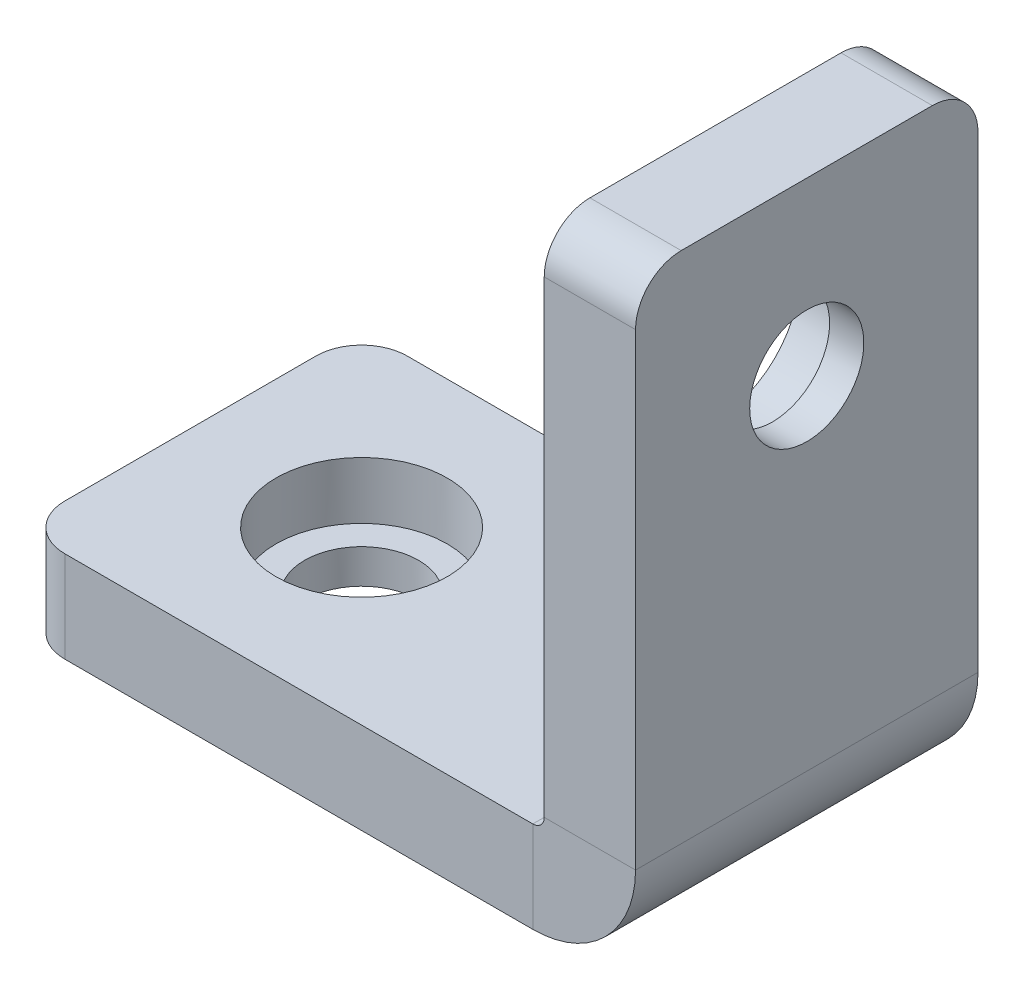
ISO-10303-21;
HEADER;
FILE_DESCRIPTION(('STEP AP214'),'2;1');
FILE_NAME('part.step','',(''),(''),'','','');
FILE_SCHEMA(('AUTOMOTIVE_DESIGN { 1 0 10303 214 1 1 1 1 }'));
ENDSEC;
DATA;
#1=APPLICATION_CONTEXT('core data for automotive mechanical design processes');
#2=APPLICATION_PROTOCOL_DEFINITION('international standard','automotive_design',2000,#1);
#3=PRODUCT_CONTEXT('',#1,'mechanical');
#4=PRODUCT('Part','Part','',(#3));
#5=PRODUCT_RELATED_PRODUCT_CATEGORY('part','',(#4));
#6=PRODUCT_DEFINITION_FORMATION('','',#4);
#7=PRODUCT_DEFINITION_CONTEXT('part definition',#1,'design');
#8=PRODUCT_DEFINITION('design','',#6,#7);
#9=PRODUCT_DEFINITION_SHAPE('','',#8);
#10=(LENGTH_UNIT() NAMED_UNIT(*) SI_UNIT(.MILLI.,.METRE.));
#11=(NAMED_UNIT(*) PLANE_ANGLE_UNIT() SI_UNIT($,.RADIAN.));
#12=(NAMED_UNIT(*) SI_UNIT($,.STERADIAN.) SOLID_ANGLE_UNIT());
#13=UNCERTAINTY_MEASURE_WITH_UNIT(LENGTH_MEASURE(1.E-05),#10,'distance_accuracy_value','');
#14=(GEOMETRIC_REPRESENTATION_CONTEXT(3) GLOBAL_UNCERTAINTY_ASSIGNED_CONTEXT((#13)) GLOBAL_UNIT_ASSIGNED_CONTEXT((#10,
#11,#12)) REPRESENTATION_CONTEXT('',''));
#15=CARTESIAN_POINT('',(0.,0.,0.));
#16=DIRECTION('',(0.,0.,1.));
#17=DIRECTION('',(1.,0.,0.));
#18=AXIS2_PLACEMENT_3D('',#15,#16,#17);
#19=CARTESIAN_POINT('',(-25.,0.,0.));
#20=DIRECTION('',(-1.,0.,0.));
#21=DIRECTION('',(0.,0.,1.));
#22=AXIS2_PLACEMENT_3D('',#19,#20,#21);
#23=PLANE('',#22);
#24=DIRECTION('',(0.,0.,1.));
#25=VECTOR('',#24,1.);
#26=CARTESIAN_POINT('',(-25.,2.,7.5));
#27=LINE('',#26,#25);
#28=CARTESIAN_POINT('',(-25.,2.,-5.5));
#29=VERTEX_POINT('',#28);
#30=CARTESIAN_POINT('',(-25.,2.,5.5));
#31=VERTEX_POINT('',#30);
#32=EDGE_CURVE('E200',#29,#31,#27,.T.);
#33=ORIENTED_EDGE('',*,*,#32,.F.);
#34=DIRECTION('',(0.,1.,0.));
#35=VECTOR('',#34,1.);
#36=CARTESIAN_POINT('',(-25.,0.,-5.5));
#37=LINE('',#36,#35);
#38=CARTESIAN_POINT('',(-25.,-2.,-5.5));
#39=VERTEX_POINT('',#38);
#40=EDGE_CURVE('E66',#29,#39,#37,.F.);
#41=ORIENTED_EDGE('',*,*,#40,.T.);
#42=DIRECTION('',(0.,0.,-1.));
#43=VECTOR('',#42,1.);
#44=CARTESIAN_POINT('',(-25.,-2.,7.5));
#45=LINE('',#44,#43);
#46=CARTESIAN_POINT('',(-25.,-2.,5.5));
#47=VERTEX_POINT('',#46);
#48=EDGE_CURVE('E149',#47,#39,#45,.T.);
#49=ORIENTED_EDGE('',*,*,#48,.F.);
#50=DIRECTION('',(0.,-1.,0.));
#51=VECTOR('',#50,1.);
#52=CARTESIAN_POINT('',(-25.,0.,5.5));
#53=LINE('',#52,#51);
#54=EDGE_CURVE('E283',#47,#31,#53,.F.);
#55=ORIENTED_EDGE('',*,*,#54,.T.);
#56=EDGE_LOOP('',(#33,#41,#49,#55));
#57=FACE_BOUND('',#56,.T.);
#58=ADVANCED_FACE('F41',(#57),#23,.T.);
#59=CARTESIAN_POINT('',(0.,25.,0.));
#60=DIRECTION('',(0.,-1.,0.));
#61=DIRECTION('',(0.,0.,1.));
#62=AXIS2_PLACEMENT_3D('',#59,#60,#61);
#63=PLANE('',#62);
#64=DIRECTION('',(0.,0.,-1.));
#65=VECTOR('',#64,1.);
#66=CARTESIAN_POINT('',(2.,25.,7.5));
#67=LINE('',#66,#65);
#68=CARTESIAN_POINT('',(2.,25.,5.5));
#69=VERTEX_POINT('',#68);
#70=CARTESIAN_POINT('',(2.,25.,-5.5));
#71=VERTEX_POINT('',#70);
#72=EDGE_CURVE('E239',#69,#71,#67,.T.);
#73=ORIENTED_EDGE('',*,*,#72,.T.);
#74=DIRECTION('',(-1.,0.,0.));
#75=VECTOR('',#74,1.);
#76=CARTESIAN_POINT('',(-2.,25.,-5.5));
#77=LINE('',#76,#75);
#78=CARTESIAN_POINT('',(-2.,25.,-5.5));
#79=VERTEX_POINT('',#78);
#80=EDGE_CURVE('E252',#71,#79,#77,.T.);
#81=ORIENTED_EDGE('',*,*,#80,.T.);
#82=DIRECTION('',(0.,0.,1.));
#83=VECTOR('',#82,1.);
#84=CARTESIAN_POINT('',(-2.,25.,7.5));
#85=LINE('',#84,#83);
#86=CARTESIAN_POINT('',(-2.,25.,5.5));
#87=VERTEX_POINT('',#86);
#88=EDGE_CURVE('E194',#79,#87,#85,.T.);
#89=ORIENTED_EDGE('',*,*,#88,.T.);
#90=DIRECTION('',(1.,0.,0.));
#91=VECTOR('',#90,1.);
#92=CARTESIAN_POINT('',(2.,25.,5.5));
#93=LINE('',#92,#91);
#94=EDGE_CURVE('E248',#87,#69,#93,.T.);
#95=ORIENTED_EDGE('',*,*,#94,.T.);
#96=EDGE_LOOP('',(#73,#81,#89,#95));
#97=FACE_BOUND('',#96,.T.);
#98=ADVANCED_FACE('F357',(#97),#63,.F.);
#99=CARTESIAN_POINT('',(-25.,-2.,-7.5));
#100=DIRECTION('',(0.,0.,-1.));
#101=DIRECTION('',(-1.,0.,0.));
#102=AXIS2_PLACEMENT_3D('',#99,#100,#101);
#103=PLANE('',#102);
#104=DIRECTION('',(1.,0.,0.));
#105=VECTOR('',#104,1.);
#106=CARTESIAN_POINT('',(-25.,-2.,-7.5));
#107=LINE('',#106,#105);
#108=CARTESIAN_POINT('',(-23.,-2.,-7.5));
#109=VERTEX_POINT('',#108);
#110=CARTESIAN_POINT('',(-2.50000000000002,-2.,-7.5));
#111=VERTEX_POINT('',#110);
#112=EDGE_CURVE('E135',#109,#111,#107,.T.);
#113=ORIENTED_EDGE('',*,*,#112,.F.);
#114=DIRECTION('',(0.,1.,0.));
#115=VECTOR('',#114,1.);
#116=CARTESIAN_POINT('',(-23.,-2.,-7.5));
#117=LINE('',#116,#115);
#118=CARTESIAN_POINT('',(-23.,2.,-7.5));
#119=VERTEX_POINT('',#118);
#120=EDGE_CURVE('E274',#109,#119,#117,.T.);
#121=ORIENTED_EDGE('',*,*,#120,.T.);
#122=DIRECTION('',(1.,0.,0.));
#123=VECTOR('',#122,1.);
#124=CARTESIAN_POINT('',(-25.,2.,-7.5));
#125=LINE('',#124,#123);
#126=CARTESIAN_POINT('',(-2.50000000000002,2.,-7.5));
#127=VERTEX_POINT('',#126);
#128=EDGE_CURVE('E173',#119,#127,#125,.T.);
#129=ORIENTED_EDGE('',*,*,#128,.T.);
#130=DIRECTION('',(0.,1.,0.));
#131=VECTOR('',#130,1.);
#132=CARTESIAN_POINT('',(-2.50000000000002,-2.,-7.5));
#133=LINE('',#132,#131);
#134=EDGE_CURVE('E148',#111,#127,#133,.T.);
#135=ORIENTED_EDGE('',*,*,#134,.F.);
#136=EDGE_LOOP('',(#113,#121,#129,#135));
#137=FACE_BOUND('',#136,.T.);
#138=ADVANCED_FACE('F171',(#137),#103,.T.);
#139=CARTESIAN_POINT('',(-25.,2.,7.5));
#140=DIRECTION('',(0.,1.,0.));
#141=DIRECTION('',(0.,0.,1.));
#142=AXIS2_PLACEMENT_3D('',#139,#140,#141);
#143=PLANE('',#142);
#144=CARTESIAN_POINT('',(-17.5,2.,0.));
#145=DIRECTION('',(0.,1.,0.));
#146=DIRECTION('',(0.,0.,1.));
#147=AXIS2_PLACEMENT_3D('',#144,#145,#146);
#148=CIRCLE('',#147,3.75);
#149=CARTESIAN_POINT('',(-17.5,2.,3.75));
#150=VERTEX_POINT('',#149);
#151=EDGE_CURVE('E316',#150,#150,#148,.T.);
#152=ORIENTED_EDGE('',*,*,#151,.F.);
#153=EDGE_LOOP('',(#152));
#154=FACE_BOUND('',#153,.T.);
#155=ORIENTED_EDGE('',*,*,#128,.F.);
#156=CARTESIAN_POINT('',(-23.,2.,-5.5));
#157=DIRECTION('',(0.,1.,0.));
#158=DIRECTION('',(0.,0.,1.));
#159=AXIS2_PLACEMENT_3D('',#156,#157,#158);
#160=CIRCLE('',#159,2.);
#161=EDGE_CURVE('E280',#119,#29,#160,.T.);
#162=ORIENTED_EDGE('',*,*,#161,.T.);
#163=ORIENTED_EDGE('',*,*,#32,.T.);
#164=CARTESIAN_POINT('',(-23.,2.,5.5));
#165=DIRECTION('',(0.,1.,0.));
#166=DIRECTION('',(0.,0.,1.));
#167=AXIS2_PLACEMENT_3D('',#164,#165,#166);
#168=CIRCLE('',#167,2.);
#169=CARTESIAN_POINT('',(-23.,2.,7.5));
#170=VERTEX_POINT('',#169);
#171=EDGE_CURVE('E277',#31,#170,#168,.T.);
#172=ORIENTED_EDGE('',*,*,#171,.T.);
#173=DIRECTION('',(1.,0.,0.));
#174=VECTOR('',#173,1.);
#175=CARTESIAN_POINT('',(-25.,2.,7.5));
#176=LINE('',#175,#174);
#177=CARTESIAN_POINT('',(-2.50000000000002,2.,7.5));
#178=VERTEX_POINT('',#177);
#179=EDGE_CURVE('E207',#170,#178,#176,.T.);
#180=ORIENTED_EDGE('',*,*,#179,.T.);
#181=DIRECTION('',(0.,0.,1.));
#182=VECTOR('',#181,1.);
#183=CARTESIAN_POINT('',(-2.50000000000002,2.,7.5));
#184=LINE('',#183,#182);
#185=EDGE_CURVE('E178',#127,#178,#184,.T.);
#186=ORIENTED_EDGE('',*,*,#185,.F.);
#187=EDGE_LOOP('',(#155,#162,#163,#172,#180,#186));
#188=FACE_BOUND('',#187,.T.);
#189=ADVANCED_FACE('F324',(#154,#188),#143,.T.);
#190=CARTESIAN_POINT('',(-25.,-2.,7.5));
#191=DIRECTION('',(0.,0.,1.));
#192=DIRECTION('',(1.,0.,0.));
#193=AXIS2_PLACEMENT_3D('',#190,#191,#192);
#194=PLANE('',#193);
#195=ORIENTED_EDGE('',*,*,#179,.F.);
#196=DIRECTION('',(0.,-1.,0.));
#197=VECTOR('',#196,1.);
#198=CARTESIAN_POINT('',(-23.,-2.,7.5));
#199=LINE('',#198,#197);
#200=CARTESIAN_POINT('',(-23.,-2.,7.5));
#201=VERTEX_POINT('',#200);
#202=EDGE_CURVE('E12',#170,#201,#199,.T.);
#203=ORIENTED_EDGE('',*,*,#202,.T.);
#204=DIRECTION('',(1.,0.,0.));
#205=VECTOR('',#204,1.);
#206=CARTESIAN_POINT('',(-25.,-2.,7.5));
#207=LINE('',#206,#205);
#208=CARTESIAN_POINT('',(-2.50000000000002,-2.,7.5));
#209=VERTEX_POINT('',#208);
#210=EDGE_CURVE('E169',#201,#209,#207,.T.);
#211=ORIENTED_EDGE('',*,*,#210,.T.);
#212=DIRECTION('',(0.,-1.,0.));
#213=VECTOR('',#212,1.);
#214=CARTESIAN_POINT('',(-2.50000000000002,-2.,7.5));
#215=LINE('',#214,#213);
#216=EDGE_CURVE('E210',#178,#209,#215,.T.);
#217=ORIENTED_EDGE('',*,*,#216,.F.);
#218=EDGE_LOOP('',(#195,#203,#211,#217));
#219=FACE_BOUND('',#218,.T.);
#220=ADVANCED_FACE('F327',(#219),#194,.T.);
#221=CARTESIAN_POINT('',(-25.,-2.,7.5));
#222=DIRECTION('',(0.,-1.,0.));
#223=DIRECTION('',(0.,0.,-1.));
#224=AXIS2_PLACEMENT_3D('',#221,#222,#223);
#225=PLANE('',#224);
#226=CARTESIAN_POINT('',(-17.5,-2.00000000000018,0.));
#227=DIRECTION('',(0.,1.,0.));
#228=DIRECTION('',(0.,0.,1.));
#229=AXIS2_PLACEMENT_3D('',#226,#227,#228);
#230=CIRCLE('',#229,2.5);
#231=CARTESIAN_POINT('',(-17.5,-2.00000000000018,2.5));
#232=VERTEX_POINT('',#231);
#233=EDGE_CURVE('E306',#232,#232,#230,.T.);
#234=ORIENTED_EDGE('',*,*,#233,.T.);
#235=EDGE_LOOP('',(#234));
#236=FACE_BOUND('',#235,.T.);
#237=ORIENTED_EDGE('',*,*,#48,.T.);
#238=CARTESIAN_POINT('',(-23.,-2.,-5.5));
#239=DIRECTION('',(0.,-1.,0.));
#240=DIRECTION('',(0.,0.,-1.));
#241=AXIS2_PLACEMENT_3D('',#238,#239,#240);
#242=CIRCLE('',#241,2.);
#243=EDGE_CURVE('E51',#39,#109,#242,.T.);
#244=ORIENTED_EDGE('',*,*,#243,.T.);
#245=ORIENTED_EDGE('',*,*,#112,.T.);
#246=DIRECTION('',(0.,0.,-1.));
#247=VECTOR('',#246,1.);
#248=CARTESIAN_POINT('',(-2.50000000000002,-2.,7.5));
#249=LINE('',#248,#247);
#250=EDGE_CURVE('E140',#209,#111,#249,.T.);
#251=ORIENTED_EDGE('',*,*,#250,.F.);
#252=ORIENTED_EDGE('',*,*,#210,.F.);
#253=CARTESIAN_POINT('',(-23.,-2.,5.5));
#254=DIRECTION('',(0.,-1.,0.));
#255=DIRECTION('',(0.,0.,-1.));
#256=AXIS2_PLACEMENT_3D('',#253,#254,#255);
#257=CIRCLE('',#256,2.);
#258=EDGE_CURVE('E59',#201,#47,#257,.T.);
#259=ORIENTED_EDGE('',*,*,#258,.T.);
#260=EDGE_LOOP('',(#237,#244,#245,#251,#252,#259));
#261=FACE_BOUND('',#260,.T.);
#262=ADVANCED_FACE('F137',(#236,#261),#225,.T.);
#263=CARTESIAN_POINT('',(-2.50000000000002,-2.00000000000018,-7.5));
#264=DIRECTION('',(0.,0.,-1.));
#265=DIRECTION('',(-1.,0.,0.));
#266=AXIS2_PLACEMENT_3D('',#263,#264,#265);
#267=PLANE('',#266);
#268=CARTESIAN_POINT('',(-2.5,2.5,-7.5));
#269=DIRECTION('',(0.,0.,1.));
#270=DIRECTION('',(0.,-1.,0.));
#271=AXIS2_PLACEMENT_3D('',#268,#269,#270);
#272=CIRCLE('',#271,0.500000000000182);
#273=CARTESIAN_POINT('',(-1.99999999999982,2.5,-7.5));
#274=VERTEX_POINT('',#273);
#275=EDGE_CURVE('E186',#127,#274,#272,.T.);
#276=ORIENTED_EDGE('',*,*,#275,.T.);
#277=DIRECTION('',(-1.,0.,0.));
#278=VECTOR('',#277,1.);
#279=CARTESIAN_POINT('',(2.,2.5,-7.5));
#280=LINE('',#279,#278);
#281=CARTESIAN_POINT('',(2.00000000000018,2.5,-7.5));
#282=VERTEX_POINT('',#281);
#283=EDGE_CURVE('E159',#282,#274,#280,.T.);
#284=ORIENTED_EDGE('',*,*,#283,.F.);
#285=CARTESIAN_POINT('',(-2.5,2.5,-7.5));
#286=DIRECTION('',(0.,0.,1.));
#287=DIRECTION('',(0.,-1.,0.));
#288=AXIS2_PLACEMENT_3D('',#285,#286,#287);
#289=CIRCLE('',#288,4.50000000000018);
#290=EDGE_CURVE('E155',#111,#282,#289,.T.);
#291=ORIENTED_EDGE('',*,*,#290,.F.);
#292=ORIENTED_EDGE('',*,*,#134,.T.);
#293=EDGE_LOOP('',(#276,#284,#291,#292));
#294=FACE_BOUND('',#293,.T.);
#295=ADVANCED_FACE('F157',(#294),#267,.T.);
#296=CARTESIAN_POINT('',(-2.5,2.5,0.));
#297=DIRECTION('',(0.,0.,1.));
#298=DIRECTION('',(1.,0.,0.));
#299=AXIS2_PLACEMENT_3D('',#296,#297,#298);
#300=CYLINDRICAL_SURFACE('',#299,0.500000000000182);
#301=CARTESIAN_POINT('',(-2.5,2.5,7.5));
#302=DIRECTION('',(0.,0.,1.));
#303=DIRECTION('',(0.,-1.,0.));
#304=AXIS2_PLACEMENT_3D('',#301,#302,#303);
#305=CIRCLE('',#304,0.500000000000182);
#306=CARTESIAN_POINT('',(-1.99999999999982,2.5,7.5));
#307=VERTEX_POINT('',#306);
#308=EDGE_CURVE('E214',#178,#307,#305,.T.);
#309=ORIENTED_EDGE('',*,*,#308,.T.);
#310=DIRECTION('',(0.,0.,1.));
#311=VECTOR('',#310,1.);
#312=CARTESIAN_POINT('',(-2.,2.5,7.5));
#313=LINE('',#312,#311);
#314=EDGE_CURVE('E188',#274,#307,#313,.T.);
#315=ORIENTED_EDGE('',*,*,#314,.F.);
#316=ORIENTED_EDGE('',*,*,#275,.F.);
#317=ORIENTED_EDGE('',*,*,#185,.T.);
#318=EDGE_LOOP('',(#309,#315,#316,#317));
#319=FACE_BOUND('',#318,.T.);
#320=ADVANCED_FACE('F333',(#319),#300,.F.);
#321=CARTESIAN_POINT('',(-2.50000000000002,-2.00000000000018,7.5));
#322=DIRECTION('',(0.,0.,1.));
#323=DIRECTION('',(1.,0.,0.));
#324=AXIS2_PLACEMENT_3D('',#321,#322,#323);
#325=PLANE('',#324);
#326=CARTESIAN_POINT('',(-2.5,2.5,7.5));
#327=DIRECTION('',(0.,0.,1.));
#328=DIRECTION('',(0.,-1.,0.));
#329=AXIS2_PLACEMENT_3D('',#326,#327,#328);
#330=CIRCLE('',#329,4.50000000000018);
#331=CARTESIAN_POINT('',(2.00000000000018,2.5,7.5));
#332=VERTEX_POINT('',#331);
#333=EDGE_CURVE('E167',#209,#332,#330,.T.);
#334=ORIENTED_EDGE('',*,*,#333,.T.);
#335=DIRECTION('',(1.,0.,0.));
#336=VECTOR('',#335,1.);
#337=CARTESIAN_POINT('',(2.,2.5,7.5));
#338=LINE('',#337,#336);
#339=EDGE_CURVE('E218',#307,#332,#338,.T.);
#340=ORIENTED_EDGE('',*,*,#339,.F.);
#341=ORIENTED_EDGE('',*,*,#308,.F.);
#342=ORIENTED_EDGE('',*,*,#216,.T.);
#343=EDGE_LOOP('',(#334,#340,#341,#342));
#344=FACE_BOUND('',#343,.T.);
#345=ADVANCED_FACE('F343',(#344),#325,.T.);
#346=CARTESIAN_POINT('',(-2.5,2.5,0.));
#347=DIRECTION('',(0.,0.,1.));
#348=DIRECTION('',(1.,0.,0.));
#349=AXIS2_PLACEMENT_3D('',#346,#347,#348);
#350=CYLINDRICAL_SURFACE('',#349,4.50000000000018);
#351=DIRECTION('',(0.,0.,-1.));
#352=VECTOR('',#351,1.);
#353=CARTESIAN_POINT('',(2.,2.5,7.5));
#354=LINE('',#353,#352);
#355=EDGE_CURVE('E199',#332,#282,#354,.T.);
#356=ORIENTED_EDGE('',*,*,#355,.F.);
#357=ORIENTED_EDGE('',*,*,#333,.F.);
#358=ORIENTED_EDGE('',*,*,#250,.T.);
#359=ORIENTED_EDGE('',*,*,#290,.T.);
#360=EDGE_LOOP('',(#356,#357,#358,#359));
#361=FACE_BOUND('',#360,.T.);
#362=ADVANCED_FACE('F165',(#361),#350,.T.);
#363=CARTESIAN_POINT('',(2.,2.5,-7.5));
#364=DIRECTION('',(0.,0.,-1.));
#365=DIRECTION('',(-1.,0.,0.));
#366=AXIS2_PLACEMENT_3D('',#363,#364,#365);
#367=PLANE('',#366);
#368=DIRECTION('',(0.,1.,0.));
#369=VECTOR('',#368,1.);
#370=CARTESIAN_POINT('',(-2.,2.5,-7.5));
#371=LINE('',#370,#369);
#372=CARTESIAN_POINT('',(-2.,23.,-7.5));
#373=VERTEX_POINT('',#372);
#374=EDGE_CURVE('E190',#274,#373,#371,.T.);
#375=ORIENTED_EDGE('',*,*,#374,.T.);
#376=DIRECTION('',(-1.,0.,0.));
#377=VECTOR('',#376,1.);
#378=CARTESIAN_POINT('',(2.,23.,-7.5));
#379=LINE('',#378,#377);
#380=CARTESIAN_POINT('',(2.,23.,-7.5));
#381=VERTEX_POINT('',#380);
#382=EDGE_CURVE('E262',#373,#381,#379,.F.);
#383=ORIENTED_EDGE('',*,*,#382,.T.);
#384=DIRECTION('',(0.,1.,0.));
#385=VECTOR('',#384,1.);
#386=CARTESIAN_POINT('',(2.,2.5,-7.5));
#387=LINE('',#386,#385);
#388=EDGE_CURVE('E195',#282,#381,#387,.T.);
#389=ORIENTED_EDGE('',*,*,#388,.F.);
#390=ORIENTED_EDGE('',*,*,#283,.T.);
#391=EDGE_LOOP('',(#375,#383,#389,#390));
#392=FACE_BOUND('',#391,.T.);
#393=ADVANCED_FACE('F336',(#392),#367,.T.);
#394=CARTESIAN_POINT('',(-2.,2.5,7.5));
#395=DIRECTION('',(-1.,0.,0.));
#396=DIRECTION('',(0.,0.,1.));
#397=AXIS2_PLACEMENT_3D('',#394,#395,#396);
#398=PLANE('',#397);
#399=CARTESIAN_POINT('',(-2.,17.5,0.));
#400=DIRECTION('',(-1.,0.,0.));
#401=DIRECTION('',(0.,0.,1.));
#402=AXIS2_PLACEMENT_3D('',#399,#400,#401);
#403=CIRCLE('',#402,3.7);
#404=CARTESIAN_POINT('',(-2.,17.5,3.7));
#405=VERTEX_POINT('',#404);
#406=EDGE_CURVE('E301',#405,#405,#403,.T.);
#407=ORIENTED_EDGE('',*,*,#406,.F.);
#408=EDGE_LOOP('',(#407));
#409=FACE_BOUND('',#408,.T.);
#410=ORIENTED_EDGE('',*,*,#88,.F.);
#411=CARTESIAN_POINT('',(-2.,23.,-5.5));
#412=DIRECTION('',(-1.,0.,0.));
#413=DIRECTION('',(0.,0.,1.));
#414=AXIS2_PLACEMENT_3D('',#411,#412,#413);
#415=CIRCLE('',#414,2.);
#416=EDGE_CURVE('E259',#79,#373,#415,.T.);
#417=ORIENTED_EDGE('',*,*,#416,.T.);
#418=ORIENTED_EDGE('',*,*,#374,.F.);
#419=ORIENTED_EDGE('',*,*,#314,.T.);
#420=DIRECTION('',(0.,1.,0.));
#421=VECTOR('',#420,1.);
#422=CARTESIAN_POINT('',(-2.,2.5,7.5));
#423=LINE('',#422,#421);
#424=CARTESIAN_POINT('',(-2.,23.,7.5));
#425=VERTEX_POINT('',#424);
#426=EDGE_CURVE('E222',#307,#425,#423,.T.);
#427=ORIENTED_EDGE('',*,*,#426,.T.);
#428=CARTESIAN_POINT('',(-2.,23.,5.5));
#429=DIRECTION('',(-1.,0.,0.));
#430=DIRECTION('',(0.,0.,1.));
#431=AXIS2_PLACEMENT_3D('',#428,#429,#430);
#432=CIRCLE('',#431,2.);
#433=EDGE_CURVE('E256',#425,#87,#432,.T.);
#434=ORIENTED_EDGE('',*,*,#433,.T.);
#435=EDGE_LOOP('',(#410,#417,#418,#419,#427,#434));
#436=FACE_BOUND('',#435,.T.);
#437=ADVANCED_FACE('F351',(#409,#436),#398,.T.);
#438=CARTESIAN_POINT('',(2.,2.5,7.5));
#439=DIRECTION('',(0.,0.,1.));
#440=DIRECTION('',(1.,0.,0.));
#441=AXIS2_PLACEMENT_3D('',#438,#439,#440);
#442=PLANE('',#441);
#443=DIRECTION('',(0.,1.,0.));
#444=VECTOR('',#443,1.);
#445=CARTESIAN_POINT('',(2.,2.5,7.5));
#446=LINE('',#445,#444);
#447=CARTESIAN_POINT('',(2.,23.,7.5));
#448=VERTEX_POINT('',#447);
#449=EDGE_CURVE('E226',#332,#448,#446,.T.);
#450=ORIENTED_EDGE('',*,*,#449,.T.);
#451=DIRECTION('',(1.,0.,0.));
#452=VECTOR('',#451,1.);
#453=CARTESIAN_POINT('',(-2.,23.,7.5));
#454=LINE('',#453,#452);
#455=EDGE_CURVE('E271',#448,#425,#454,.F.);
#456=ORIENTED_EDGE('',*,*,#455,.T.);
#457=ORIENTED_EDGE('',*,*,#426,.F.);
#458=ORIENTED_EDGE('',*,*,#339,.T.);
#459=EDGE_LOOP('',(#450,#456,#457,#458));
#460=FACE_BOUND('',#459,.T.);
#461=ADVANCED_FACE('F346',(#460),#442,.T.);
#462=CARTESIAN_POINT('',(2.,2.5,7.5));
#463=DIRECTION('',(1.,0.,0.));
#464=DIRECTION('',(0.,0.,-1.));
#465=AXIS2_PLACEMENT_3D('',#462,#463,#464);
#466=PLANE('',#465);
#467=CARTESIAN_POINT('',(2.00000000000018,17.5,0.));
#468=DIRECTION('',(-1.,0.,0.));
#469=DIRECTION('',(0.,0.,1.));
#470=AXIS2_PLACEMENT_3D('',#467,#468,#469);
#471=CIRCLE('',#470,2.5);
#472=CARTESIAN_POINT('',(2.00000000000018,17.5,2.5));
#473=VERTEX_POINT('',#472);
#474=EDGE_CURVE('E181',#473,#473,#471,.T.);
#475=ORIENTED_EDGE('',*,*,#474,.T.);
#476=EDGE_LOOP('',(#475));
#477=FACE_BOUND('',#476,.T.);
#478=ORIENTED_EDGE('',*,*,#388,.T.);
#479=CARTESIAN_POINT('',(2.,23.,-5.5));
#480=DIRECTION('',(1.,0.,0.));
#481=DIRECTION('',(0.,0.,-1.));
#482=AXIS2_PLACEMENT_3D('',#479,#480,#481);
#483=CIRCLE('',#482,2.);
#484=EDGE_CURVE('E268',#381,#71,#483,.T.);
#485=ORIENTED_EDGE('',*,*,#484,.T.);
#486=ORIENTED_EDGE('',*,*,#72,.F.);
#487=CARTESIAN_POINT('',(2.,23.,5.5));
#488=DIRECTION('',(1.,0.,0.));
#489=DIRECTION('',(0.,0.,-1.));
#490=AXIS2_PLACEMENT_3D('',#487,#488,#489);
#491=CIRCLE('',#490,2.);
#492=EDGE_CURVE('E265',#69,#448,#491,.T.);
#493=ORIENTED_EDGE('',*,*,#492,.T.);
#494=ORIENTED_EDGE('',*,*,#449,.F.);
#495=ORIENTED_EDGE('',*,*,#355,.T.);
#496=EDGE_LOOP('',(#478,#485,#486,#493,#494,#495));
#497=FACE_BOUND('',#496,.T.);
#498=ADVANCED_FACE('F340',(#477,#497),#466,.T.);
#499=CARTESIAN_POINT('',(2.00000000000018,17.5,0.));
#500=DIRECTION('',(-1.,0.,0.));
#501=DIRECTION('',(0.,0.,1.));
#502=AXIS2_PLACEMENT_3D('',#499,#500,#501);
#503=CYLINDRICAL_SURFACE('',#502,2.5);
#504=CARTESIAN_POINT('',(0.5,17.5,0.));
#505=DIRECTION('',(1.,0.,0.));
#506=DIRECTION('',(0.,0.,-1.));
#507=AXIS2_PLACEMENT_3D('',#504,#505,#506);
#508=CIRCLE('',#507,2.5);
#509=CARTESIAN_POINT('',(0.5,17.5,-2.5));
#510=VERTEX_POINT('',#509);
#511=EDGE_CURVE('E291',#510,#510,#508,.F.);
#512=ORIENTED_EDGE('',*,*,#511,.T.);
#513=EDGE_LOOP('',(#512));
#514=FACE_BOUND('',#513,.T.);
#515=ORIENTED_EDGE('',*,*,#474,.F.);
#516=EDGE_LOOP('',(#515));
#517=FACE_BOUND('',#516,.T.);
#518=ADVANCED_FACE('F362',(#514,#517),#503,.F.);
#519=CARTESIAN_POINT('',(0.,23.,-5.5));
#520=DIRECTION('',(1.,0.,0.));
#521=DIRECTION('',(0.,0.,-1.));
#522=AXIS2_PLACEMENT_3D('',#519,#520,#521);
#523=CYLINDRICAL_SURFACE('',#522,2.);
#524=ORIENTED_EDGE('',*,*,#484,.F.);
#525=ORIENTED_EDGE('',*,*,#382,.F.);
#526=ORIENTED_EDGE('',*,*,#416,.F.);
#527=ORIENTED_EDGE('',*,*,#80,.F.);
#528=EDGE_LOOP('',(#524,#525,#526,#527));
#529=FACE_BOUND('',#528,.T.);
#530=ADVANCED_FACE('F360',(#529),#523,.T.);
#531=CARTESIAN_POINT('',(0.,23.,5.5));
#532=DIRECTION('',(-1.,0.,0.));
#533=DIRECTION('',(0.,0.,1.));
#534=AXIS2_PLACEMENT_3D('',#531,#532,#533);
#535=CYLINDRICAL_SURFACE('',#534,2.);
#536=ORIENTED_EDGE('',*,*,#433,.F.);
#537=ORIENTED_EDGE('',*,*,#455,.F.);
#538=ORIENTED_EDGE('',*,*,#492,.F.);
#539=ORIENTED_EDGE('',*,*,#94,.F.);
#540=EDGE_LOOP('',(#536,#537,#538,#539));
#541=FACE_BOUND('',#540,.T.);
#542=ADVANCED_FACE('F354',(#541),#535,.T.);
#543=CARTESIAN_POINT('',(-23.,-2.,-5.5));
#544=DIRECTION('',(0.,1.,0.));
#545=DIRECTION('',(0.,0.,1.));
#546=AXIS2_PLACEMENT_3D('',#543,#544,#545);
#547=CYLINDRICAL_SURFACE('',#546,2.);
#548=ORIENTED_EDGE('',*,*,#243,.F.);
#549=ORIENTED_EDGE('',*,*,#40,.F.);
#550=ORIENTED_EDGE('',*,*,#161,.F.);
#551=ORIENTED_EDGE('',*,*,#120,.F.);
#552=EDGE_LOOP('',(#548,#549,#550,#551));
#553=FACE_BOUND('',#552,.T.);
#554=ADVANCED_FACE('F368',(#553),#547,.T.);
#555=CARTESIAN_POINT('',(-23.,-2.,5.5));
#556=DIRECTION('',(0.,-1.,0.));
#557=DIRECTION('',(0.,0.,-1.));
#558=AXIS2_PLACEMENT_3D('',#555,#556,#557);
#559=CYLINDRICAL_SURFACE('',#558,2.);
#560=ORIENTED_EDGE('',*,*,#171,.F.);
#561=ORIENTED_EDGE('',*,*,#54,.F.);
#562=ORIENTED_EDGE('',*,*,#258,.F.);
#563=ORIENTED_EDGE('',*,*,#202,.F.);
#564=EDGE_LOOP('',(#560,#561,#562,#563));
#565=FACE_BOUND('',#564,.T.);
#566=ADVANCED_FACE('F43',(#565),#559,.T.);
#567=CARTESIAN_POINT('',(0.5,2.5,7.5));
#568=DIRECTION('',(1.,0.,0.));
#569=DIRECTION('',(0.,0.,-1.));
#570=AXIS2_PLACEMENT_3D('',#567,#568,#569);
#571=PLANE('',#570);
#572=CARTESIAN_POINT('',(0.5,17.5,0.));
#573=DIRECTION('',(1.,0.,0.));
#574=DIRECTION('',(0.,0.,-1.));
#575=AXIS2_PLACEMENT_3D('',#572,#573,#574);
#576=CIRCLE('',#575,3.7);
#577=CARTESIAN_POINT('',(0.5,17.5,-3.7));
#578=VERTEX_POINT('',#577);
#579=EDGE_CURVE('E294',#578,#578,#576,.F.);
#580=ORIENTED_EDGE('',*,*,#579,.T.);
#581=EDGE_LOOP('',(#580));
#582=FACE_BOUND('',#581,.T.);
#583=ORIENTED_EDGE('',*,*,#511,.F.);
#584=EDGE_LOOP('',(#583));
#585=FACE_BOUND('',#584,.T.);
#586=ADVANCED_FACE('F392',(#582,#585),#571,.F.);
#587=CARTESIAN_POINT('',(12.4651803615609,17.5,0.));
#588=DIRECTION('',(-1.,0.,0.));
#589=DIRECTION('',(0.,0.,1.));
#590=AXIS2_PLACEMENT_3D('',#587,#588,#589);
#591=CYLINDRICAL_SURFACE('',#590,3.7);
#592=ORIENTED_EDGE('',*,*,#406,.T.);
#593=EDGE_LOOP('',(#592));
#594=FACE_BOUND('',#593,.T.);
#595=ORIENTED_EDGE('',*,*,#579,.F.);
#596=EDGE_LOOP('',(#595));
#597=FACE_BOUND('',#596,.T.);
#598=ADVANCED_FACE('F396',(#594,#597),#591,.F.);
#599=CARTESIAN_POINT('',(-17.5,-2.00000000000018,0.));
#600=DIRECTION('',(0.,1.,0.));
#601=DIRECTION('',(0.,0.,1.));
#602=AXIS2_PLACEMENT_3D('',#599,#600,#601);
#603=CYLINDRICAL_SURFACE('',#602,2.5);
#604=CARTESIAN_POINT('',(-17.5,-0.5,0.));
#605=DIRECTION('',(0.,-1.,0.));
#606=DIRECTION('',(0.,0.,-1.));
#607=AXIS2_PLACEMENT_3D('',#604,#605,#606);
#608=CIRCLE('',#607,2.5);
#609=CARTESIAN_POINT('',(-17.5,-0.5,-2.5));
#610=VERTEX_POINT('',#609);
#611=EDGE_CURVE('E45',#610,#610,#608,.F.);
#612=ORIENTED_EDGE('',*,*,#611,.T.);
#613=EDGE_LOOP('',(#612));
#614=FACE_BOUND('',#613,.T.);
#615=ORIENTED_EDGE('',*,*,#233,.F.);
#616=EDGE_LOOP('',(#615));
#617=FACE_BOUND('',#616,.T.);
#618=ADVANCED_FACE('F424',(#614,#617),#603,.F.);
#619=CARTESIAN_POINT('',(-25.,-0.5,7.5));
#620=DIRECTION('',(0.,-1.,0.));
#621=DIRECTION('',(0.,0.,-1.));
#622=AXIS2_PLACEMENT_3D('',#619,#620,#621);
#623=PLANE('',#622);
#624=CARTESIAN_POINT('',(-17.5,-0.5,0.));
#625=DIRECTION('',(0.,-1.,0.));
#626=DIRECTION('',(0.,0.,-1.));
#627=AXIS2_PLACEMENT_3D('',#624,#625,#626);
#628=CIRCLE('',#627,3.75);
#629=CARTESIAN_POINT('',(-17.5,-0.5,-3.75));
#630=VERTEX_POINT('',#629);
#631=EDGE_CURVE('E312',#630,#630,#628,.F.);
#632=ORIENTED_EDGE('',*,*,#631,.T.);
#633=EDGE_LOOP('',(#632));
#634=FACE_BOUND('',#633,.T.);
#635=ORIENTED_EDGE('',*,*,#611,.F.);
#636=EDGE_LOOP('',(#635));
#637=FACE_BOUND('',#636,.T.);
#638=ADVANCED_FACE('F428',(#634,#637),#623,.F.);
#639=CARTESIAN_POINT('',(-17.5,-12.6066017177982,0.));
#640=DIRECTION('',(0.,1.,0.));
#641=DIRECTION('',(0.,0.,1.));
#642=AXIS2_PLACEMENT_3D('',#639,#640,#641);
#643=CYLINDRICAL_SURFACE('',#642,3.75);
#644=ORIENTED_EDGE('',*,*,#151,.T.);
#645=EDGE_LOOP('',(#644));
#646=FACE_BOUND('',#645,.T.);
#647=ORIENTED_EDGE('',*,*,#631,.F.);
#648=EDGE_LOOP('',(#647));
#649=FACE_BOUND('',#648,.T.);
#650=ADVANCED_FACE('F321',(#646,#649),#643,.F.);
#651=CLOSED_SHELL('',(#58,#98,#138,#189,#220,#262,#295,#320,#345,#362,#393,#437,#461,#498,#518,
#530,#542,#554,#566,#586,#598,#618,#638,#650));
#652=MANIFOLD_SOLID_BREP('B2',#651);
#653=ADVANCED_BREP_SHAPE_REPRESENTATION('',(#18,#652),#14);
#654=SHAPE_DEFINITION_REPRESENTATION(#9,#653);
ENDSEC;
END-ISO-10303-21;
